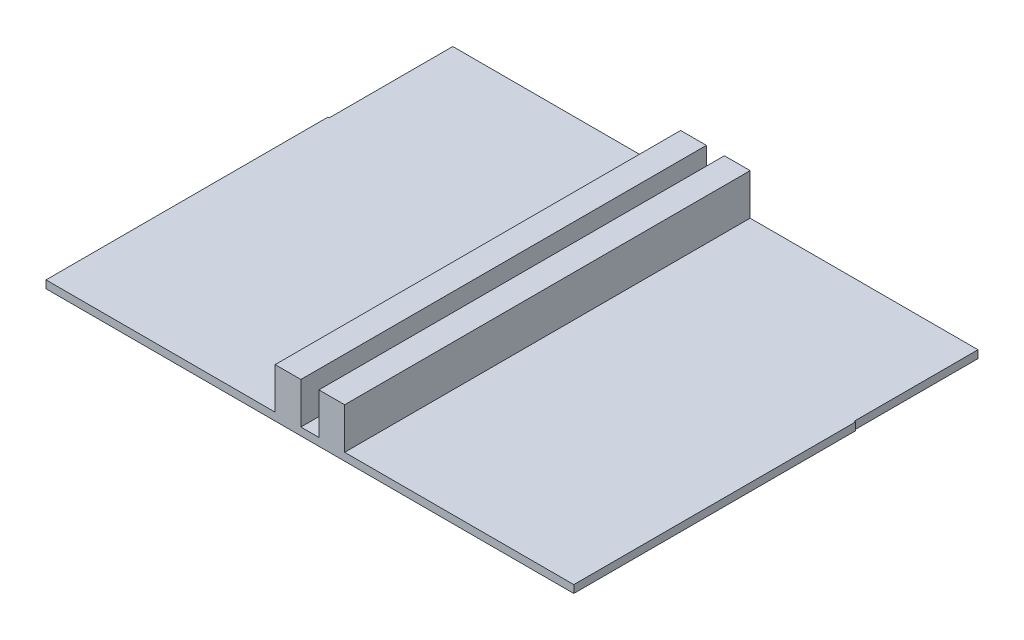
ISO-10303-21;
HEADER;
FILE_DESCRIPTION(('STEP AP214'),'2;1');
FILE_NAME('part.step','',(''),(''),'','','');
FILE_SCHEMA(('AUTOMOTIVE_DESIGN { 1 0 10303 214 1 1 1 1 }'));
ENDSEC;
DATA;
#1=APPLICATION_CONTEXT('core data for automotive mechanical design processes');
#2=APPLICATION_PROTOCOL_DEFINITION('international standard','automotive_design',2000,#1);
#3=PRODUCT_CONTEXT('',#1,'mechanical');
#4=PRODUCT('Part','Part','',(#3));
#5=PRODUCT_RELATED_PRODUCT_CATEGORY('part','',(#4));
#6=PRODUCT_DEFINITION_FORMATION('','',#4);
#7=PRODUCT_DEFINITION_CONTEXT('part definition',#1,'design');
#8=PRODUCT_DEFINITION('design','',#6,#7);
#9=PRODUCT_DEFINITION_SHAPE('','',#8);
#10=(LENGTH_UNIT() NAMED_UNIT(*) SI_UNIT(.MILLI.,.METRE.));
#11=(NAMED_UNIT(*) PLANE_ANGLE_UNIT() SI_UNIT($,.RADIAN.));
#12=(NAMED_UNIT(*) SI_UNIT($,.STERADIAN.) SOLID_ANGLE_UNIT());
#13=UNCERTAINTY_MEASURE_WITH_UNIT(LENGTH_MEASURE(1.E-05),#10,'distance_accuracy_value','');
#14=(GEOMETRIC_REPRESENTATION_CONTEXT(3) GLOBAL_UNCERTAINTY_ASSIGNED_CONTEXT((#13)) GLOBAL_UNIT_ASSIGNED_CONTEXT((#10,
#11,#12)) REPRESENTATION_CONTEXT('',''));
#15=CARTESIAN_POINT('',(0.,0.,0.));
#16=DIRECTION('',(0.,0.,1.));
#17=DIRECTION('',(1.,0.,0.));
#18=AXIS2_PLACEMENT_3D('',#15,#16,#17);
#19=CARTESIAN_POINT('',(0.,0.3,0.));
#20=DIRECTION('',(0.,1.,0.));
#21=DIRECTION('',(0.,0.,1.));
#22=AXIS2_PLACEMENT_3D('',#19,#20,#21);
#23=PLANE('',#22);
#24=DIRECTION('',(1.,0.,0.));
#25=VECTOR('',#24,1.);
#26=CARTESIAN_POINT('',(0.,0.3,0.));
#27=LINE('',#26,#25);
#28=CARTESIAN_POINT('',(1.35000000000001,0.3,0.));
#29=VERTEX_POINT('',#28);
#30=CARTESIAN_POINT('',(10.25,0.3,0.));
#31=VERTEX_POINT('',#30);
#32=EDGE_CURVE('E210',#29,#31,#27,.T.);
#33=ORIENTED_EDGE('',*,*,#32,.T.);
#34=DIRECTION('',(0.,0.,-1.));
#35=VECTOR('',#34,1.);
#36=CARTESIAN_POINT('',(10.25,0.3,0.));
#37=LINE('',#36,#35);
#38=CARTESIAN_POINT('',(10.25,0.3,-10.95));
#39=VERTEX_POINT('',#38);
#40=EDGE_CURVE('E171',#31,#39,#37,.T.);
#41=ORIENTED_EDGE('',*,*,#40,.T.);
#42=DIRECTION('',(1.,0.,0.));
#43=VECTOR('',#42,1.);
#44=CARTESIAN_POINT('',(0.,0.3,-10.95));
#45=LINE('',#44,#43);
#46=CARTESIAN_POINT('',(10.2,0.3,-10.95));
#47=VERTEX_POINT('',#46);
#48=EDGE_CURVE('E293',#47,#39,#45,.T.);
#49=ORIENTED_EDGE('',*,*,#48,.F.);
#50=DIRECTION('',(0.,0.,1.));
#51=VECTOR('',#50,1.);
#52=CARTESIAN_POINT('',(10.2,0.3,0.));
#53=LINE('',#52,#51);
#54=CARTESIAN_POINT('',(10.2,0.3,-15.75));
#55=VERTEX_POINT('',#54);
#56=EDGE_CURVE('E297',#55,#47,#53,.T.);
#57=ORIENTED_EDGE('',*,*,#56,.F.);
#58=DIRECTION('',(1.,0.,0.));
#59=VECTOR('',#58,1.);
#60=CARTESIAN_POINT('',(0.,0.3,-15.75));
#61=LINE('',#60,#59);
#62=CARTESIAN_POINT('',(1.35000000000001,0.3,-15.75));
#63=VERTEX_POINT('',#62);
#64=EDGE_CURVE('E229',#63,#55,#61,.T.);
#65=ORIENTED_EDGE('',*,*,#64,.F.);
#66=DIRECTION('',(0.,0.,-1.));
#67=VECTOR('',#66,1.);
#68=CARTESIAN_POINT('',(1.35,0.3,-15.75));
#69=LINE('',#68,#67);
#70=EDGE_CURVE('E264',#29,#63,#69,.T.);
#71=ORIENTED_EDGE('',*,*,#70,.F.);
#72=EDGE_LOOP('',(#33,#41,#49,#57,#65,#71));
#73=FACE_BOUND('',#72,.T.);
#74=ADVANCED_FACE('F34',(#73),#23,.T.);
#75=CARTESIAN_POINT('',(0.,0.3,0.));
#76=DIRECTION('',(0.,0.,-1.));
#77=DIRECTION('',(-1.,0.,0.));
#78=AXIS2_PLACEMENT_3D('',#75,#76,#77);
#79=PLANE('',#78);
#80=CARTESIAN_POINT('',(-10.25,0.3,0.));
#81=VERTEX_POINT('',#80);
#82=CARTESIAN_POINT('',(-1.35,0.3,0.));
#83=VERTEX_POINT('',#82);
#84=EDGE_CURVE('E170',#81,#83,#27,.T.);
#85=ORIENTED_EDGE('',*,*,#84,.F.);
#86=DIRECTION('',(0.,-1.,0.));
#87=VECTOR('',#86,1.);
#88=CARTESIAN_POINT('',(-10.25,10.,0.));
#89=LINE('',#88,#87);
#90=CARTESIAN_POINT('',(-10.25,0.,0.));
#91=VERTEX_POINT('',#90);
#92=EDGE_CURVE('E158',#81,#91,#89,.T.);
#93=ORIENTED_EDGE('',*,*,#92,.T.);
#94=DIRECTION('',(1.,0.,0.));
#95=VECTOR('',#94,1.);
#96=CARTESIAN_POINT('',(0.,0.,0.));
#97=LINE('',#96,#95);
#98=CARTESIAN_POINT('',(10.25,0.,0.));
#99=VERTEX_POINT('',#98);
#100=EDGE_CURVE('E168',#91,#99,#97,.T.);
#101=ORIENTED_EDGE('',*,*,#100,.T.);
#102=DIRECTION('',(0.,-1.,0.));
#103=VECTOR('',#102,1.);
#104=CARTESIAN_POINT('',(10.25,10.,0.));
#105=LINE('',#104,#103);
#106=EDGE_CURVE('E57',#31,#99,#105,.T.);
#107=ORIENTED_EDGE('',*,*,#106,.F.);
#108=ORIENTED_EDGE('',*,*,#32,.F.);
#109=DIRECTION('',(0.,-1.,0.));
#110=VECTOR('',#109,1.);
#111=CARTESIAN_POINT('',(1.35000000000001,1.9,0.));
#112=LINE('',#111,#110);
#113=CARTESIAN_POINT('',(1.35000000000001,1.9,0.));
#114=VERTEX_POINT('',#113);
#115=EDGE_CURVE('E256',#114,#29,#112,.T.);
#116=ORIENTED_EDGE('',*,*,#115,.F.);
#117=DIRECTION('',(1.,0.,0.));
#118=VECTOR('',#117,1.);
#119=CARTESIAN_POINT('',(0.35000000000001,1.9,0.));
#120=LINE('',#119,#118);
#121=CARTESIAN_POINT('',(0.35000000000001,1.9,0.));
#122=VERTEX_POINT('',#121);
#123=EDGE_CURVE('E258',#122,#114,#120,.T.);
#124=ORIENTED_EDGE('',*,*,#123,.F.);
#125=DIRECTION('',(0.,-1.,0.));
#126=VECTOR('',#125,1.);
#127=CARTESIAN_POINT('',(0.35000000000001,1.9,0.));
#128=LINE('',#127,#126);
#129=CARTESIAN_POINT('',(0.349999999999996,0.3,0.));
#130=VERTEX_POINT('',#129);
#131=EDGE_CURVE('E270',#122,#130,#128,.T.);
#132=ORIENTED_EDGE('',*,*,#131,.T.);
#133=CARTESIAN_POINT('',(-0.35,0.3,0.));
#134=VERTEX_POINT('',#133);
#135=EDGE_CURVE('E294',#134,#130,#27,.T.);
#136=ORIENTED_EDGE('',*,*,#135,.F.);
#137=DIRECTION('',(0.,-1.,0.));
#138=VECTOR('',#137,1.);
#139=CARTESIAN_POINT('',(-0.35,1.9,0.));
#140=LINE('',#139,#138);
#141=CARTESIAN_POINT('',(-0.35,1.9,0.));
#142=VERTEX_POINT('',#141);
#143=EDGE_CURVE('E284',#142,#134,#140,.T.);
#144=ORIENTED_EDGE('',*,*,#143,.F.);
#145=DIRECTION('',(1.,0.,0.));
#146=VECTOR('',#145,1.);
#147=CARTESIAN_POINT('',(-0.35,1.9,0.));
#148=LINE('',#147,#146);
#149=CARTESIAN_POINT('',(-1.35,1.9,0.));
#150=VERTEX_POINT('',#149);
#151=EDGE_CURVE('E282',#150,#142,#148,.T.);
#152=ORIENTED_EDGE('',*,*,#151,.F.);
#153=DIRECTION('',(0.,-1.,0.));
#154=VECTOR('',#153,1.);
#155=CARTESIAN_POINT('',(-1.35,1.9,0.));
#156=LINE('',#155,#154);
#157=EDGE_CURVE('E182',#150,#83,#156,.T.);
#158=ORIENTED_EDGE('',*,*,#157,.T.);
#159=EDGE_LOOP('',(#85,#93,#101,#107,#108,#116,#124,#132,#136,#144,#152,#158));
#160=FACE_BOUND('',#159,.T.);
#161=ADVANCED_FACE('F36',(#160),#79,.F.);
#162=CARTESIAN_POINT('',(0.,0.3,-10.95));
#163=DIRECTION('',(0.,0.,-1.));
#164=DIRECTION('',(-1.,0.,0.));
#165=AXIS2_PLACEMENT_3D('',#162,#163,#164);
#166=PLANE('',#165);
#167=ORIENTED_EDGE('',*,*,#48,.T.);
#168=DIRECTION('',(0.,-1.,0.));
#169=VECTOR('',#168,1.);
#170=CARTESIAN_POINT('',(10.25,10.,-10.95));
#171=LINE('',#170,#169);
#172=CARTESIAN_POINT('',(10.25,0.,-10.95));
#173=VERTEX_POINT('',#172);
#174=EDGE_CURVE('E163',#39,#173,#171,.T.);
#175=ORIENTED_EDGE('',*,*,#174,.T.);
#176=DIRECTION('',(1.,0.,0.));
#177=VECTOR('',#176,1.);
#178=CARTESIAN_POINT('',(0.,0.,-10.95));
#179=LINE('',#178,#177);
#180=CARTESIAN_POINT('',(10.2,0.,-10.95));
#181=VERTEX_POINT('',#180);
#182=EDGE_CURVE('E176',#181,#173,#179,.T.);
#183=ORIENTED_EDGE('',*,*,#182,.F.);
#184=DIRECTION('',(0.,-1.,0.));
#185=VECTOR('',#184,1.);
#186=CARTESIAN_POINT('',(10.2,0.3,-10.95));
#187=LINE('',#186,#185);
#188=EDGE_CURVE('E11',#47,#181,#187,.T.);
#189=ORIENTED_EDGE('',*,*,#188,.F.);
#190=EDGE_LOOP('',(#167,#175,#183,#189));
#191=FACE_BOUND('',#190,.T.);
#192=ADVANCED_FACE('F328',(#191),#166,.T.);
#193=CARTESIAN_POINT('',(0.,0.,0.));
#194=DIRECTION('',(0.,1.,0.));
#195=DIRECTION('',(0.,0.,1.));
#196=AXIS2_PLACEMENT_3D('',#193,#194,#195);
#197=PLANE('',#196);
#198=ORIENTED_EDGE('',*,*,#100,.F.);
#199=DIRECTION('',(0.,0.,1.));
#200=VECTOR('',#199,1.);
#201=CARTESIAN_POINT('',(-10.25,0.,0.));
#202=LINE('',#201,#200);
#203=CARTESIAN_POINT('',(-10.25,0.,-10.95));
#204=VERTEX_POINT('',#203);
#205=EDGE_CURVE('E155',#204,#91,#202,.T.);
#206=ORIENTED_EDGE('',*,*,#205,.F.);
#207=DIRECTION('',(1.,0.,0.));
#208=VECTOR('',#207,1.);
#209=CARTESIAN_POINT('',(0.,0.,-10.95));
#210=LINE('',#209,#208);
#211=CARTESIAN_POINT('',(-10.2,0.,-10.95));
#212=VERTEX_POINT('',#211);
#213=EDGE_CURVE('E208',#204,#212,#210,.T.);
#214=ORIENTED_EDGE('',*,*,#213,.T.);
#215=DIRECTION('',(0.,0.,1.));
#216=VECTOR('',#215,1.);
#217=CARTESIAN_POINT('',(-10.2,0.,0.));
#218=LINE('',#217,#216);
#219=CARTESIAN_POINT('',(-10.2,0.,-15.75));
#220=VERTEX_POINT('',#219);
#221=EDGE_CURVE('E205',#220,#212,#218,.T.);
#222=ORIENTED_EDGE('',*,*,#221,.F.);
#223=DIRECTION('',(1.,0.,0.));
#224=VECTOR('',#223,1.);
#225=CARTESIAN_POINT('',(0.,0.,-15.75));
#226=LINE('',#225,#224);
#227=CARTESIAN_POINT('',(-0.35,0.,-15.75));
#228=VERTEX_POINT('',#227);
#229=EDGE_CURVE('E202',#220,#228,#226,.T.);
#230=ORIENTED_EDGE('',*,*,#229,.T.);
#231=DIRECTION('',(0.,0.,1.));
#232=VECTOR('',#231,1.);
#233=CARTESIAN_POINT('',(-0.35,0.,0.));
#234=LINE('',#233,#232);
#235=CARTESIAN_POINT('',(-0.35,0.,-11.));
#236=VERTEX_POINT('',#235);
#237=EDGE_CURVE('E199',#228,#236,#234,.T.);
#238=ORIENTED_EDGE('',*,*,#237,.T.);
#239=DIRECTION('',(1.,0.,0.));
#240=VECTOR('',#239,1.);
#241=CARTESIAN_POINT('',(0.,0.,-11.));
#242=LINE('',#241,#240);
#243=CARTESIAN_POINT('',(0.35,0.,-11.));
#244=VERTEX_POINT('',#243);
#245=EDGE_CURVE('E196',#236,#244,#242,.T.);
#246=ORIENTED_EDGE('',*,*,#245,.T.);
#247=DIRECTION('',(0.,0.,1.));
#248=VECTOR('',#247,1.);
#249=CARTESIAN_POINT('',(0.35,0.,0.));
#250=LINE('',#249,#248);
#251=CARTESIAN_POINT('',(0.35,0.,-15.75));
#252=VERTEX_POINT('',#251);
#253=EDGE_CURVE('E193',#252,#244,#250,.T.);
#254=ORIENTED_EDGE('',*,*,#253,.F.);
#255=DIRECTION('',(1.,0.,0.));
#256=VECTOR('',#255,1.);
#257=CARTESIAN_POINT('',(0.,0.,-15.75));
#258=LINE('',#257,#256);
#259=CARTESIAN_POINT('',(10.2,0.,-15.75));
#260=VERTEX_POINT('',#259);
#261=EDGE_CURVE('E190',#252,#260,#258,.T.);
#262=ORIENTED_EDGE('',*,*,#261,.T.);
#263=DIRECTION('',(0.,0.,1.));
#264=VECTOR('',#263,1.);
#265=CARTESIAN_POINT('',(10.2,0.,0.));
#266=LINE('',#265,#264);
#267=EDGE_CURVE('E179',#260,#181,#266,.T.);
#268=ORIENTED_EDGE('',*,*,#267,.T.);
#269=ORIENTED_EDGE('',*,*,#182,.T.);
#270=DIRECTION('',(0.,0.,1.));
#271=VECTOR('',#270,1.);
#272=CARTESIAN_POINT('',(10.25,0.,0.));
#273=LINE('',#272,#271);
#274=EDGE_CURVE('E175',#173,#99,#273,.T.);
#275=ORIENTED_EDGE('',*,*,#274,.T.);
#276=EDGE_LOOP('',(#198,#206,#214,#222,#230,#238,#246,#254,#262,#268,#269,#275));
#277=FACE_BOUND('',#276,.T.);
#278=ADVANCED_FACE('F173',(#277),#197,.F.);
#279=ORIENTED_EDGE('',*,*,#135,.T.);
#280=DIRECTION('',(0.,0.,1.));
#281=VECTOR('',#280,1.);
#282=CARTESIAN_POINT('',(0.349999999999996,0.3,-15.75));
#283=LINE('',#282,#281);
#284=CARTESIAN_POINT('',(0.35,0.3,-11.));
#285=VERTEX_POINT('',#284);
#286=EDGE_CURVE('E262',#285,#130,#283,.T.);
#287=ORIENTED_EDGE('',*,*,#286,.F.);
#288=DIRECTION('',(1.,0.,0.));
#289=VECTOR('',#288,1.);
#290=CARTESIAN_POINT('',(0.,0.3,-11.));
#291=LINE('',#290,#289);
#292=CARTESIAN_POINT('',(-0.35,0.3,-11.));
#293=VERTEX_POINT('',#292);
#294=EDGE_CURVE('E300',#293,#285,#291,.T.);
#295=ORIENTED_EDGE('',*,*,#294,.F.);
#296=DIRECTION('',(0.,0.,-1.));
#297=VECTOR('',#296,1.);
#298=CARTESIAN_POINT('',(-0.35,0.3,-15.75));
#299=LINE('',#298,#297);
#300=EDGE_CURVE('E273',#134,#293,#299,.T.);
#301=ORIENTED_EDGE('',*,*,#300,.F.);
#302=EDGE_LOOP('',(#279,#287,#295,#301));
#303=FACE_BOUND('',#302,.T.);
#304=ADVANCED_FACE('F344',(#303),#23,.T.);
#305=CARTESIAN_POINT('',(10.2,0.3,0.));
#306=DIRECTION('',(1.,0.,0.));
#307=DIRECTION('',(0.,0.,-1.));
#308=AXIS2_PLACEMENT_3D('',#305,#306,#307);
#309=PLANE('',#308);
#310=ORIENTED_EDGE('',*,*,#267,.F.);
#311=DIRECTION('',(0.,-1.,0.));
#312=VECTOR('',#311,1.);
#313=CARTESIAN_POINT('',(10.2,0.3,-15.75));
#314=LINE('',#313,#312);
#315=EDGE_CURVE('E42',#55,#260,#314,.T.);
#316=ORIENTED_EDGE('',*,*,#315,.F.);
#317=ORIENTED_EDGE('',*,*,#56,.T.);
#318=ORIENTED_EDGE('',*,*,#188,.T.);
#319=EDGE_LOOP('',(#310,#316,#317,#318));
#320=FACE_BOUND('',#319,.T.);
#321=ADVANCED_FACE('F233',(#320),#309,.T.);
#322=CARTESIAN_POINT('',(0.,0.3,-15.75));
#323=DIRECTION('',(0.,0.,-1.));
#324=DIRECTION('',(-1.,0.,0.));
#325=AXIS2_PLACEMENT_3D('',#322,#323,#324);
#326=PLANE('',#325);
#327=ORIENTED_EDGE('',*,*,#261,.F.);
#328=DIRECTION('',(0.,-1.,0.));
#329=VECTOR('',#328,1.);
#330=CARTESIAN_POINT('',(0.35,0.3,-15.75));
#331=LINE('',#330,#329);
#332=CARTESIAN_POINT('',(0.349999999999996,1.9,-15.75));
#333=VERTEX_POINT('',#332);
#334=EDGE_CURVE('E222',#333,#252,#331,.T.);
#335=ORIENTED_EDGE('',*,*,#334,.F.);
#336=DIRECTION('',(-1.,0.,0.));
#337=VECTOR('',#336,1.);
#338=CARTESIAN_POINT('',(0.349999999999996,1.9,-15.75));
#339=LINE('',#338,#337);
#340=CARTESIAN_POINT('',(1.35,1.9,-15.75));
#341=VERTEX_POINT('',#340);
#342=EDGE_CURVE('E248',#341,#333,#339,.T.);
#343=ORIENTED_EDGE('',*,*,#342,.F.);
#344=DIRECTION('',(0.,-1.,0.));
#345=VECTOR('',#344,1.);
#346=CARTESIAN_POINT('',(1.35,1.9,-15.75));
#347=LINE('',#346,#345);
#348=EDGE_CURVE('E254',#341,#63,#347,.T.);
#349=ORIENTED_EDGE('',*,*,#348,.T.);
#350=ORIENTED_EDGE('',*,*,#64,.T.);
#351=ORIENTED_EDGE('',*,*,#315,.T.);
#352=EDGE_LOOP('',(#327,#335,#343,#349,#350,#351));
#353=FACE_BOUND('',#352,.T.);
#354=ADVANCED_FACE('F227',(#353),#326,.T.);
#355=CARTESIAN_POINT('',(0.35,0.3,0.));
#356=DIRECTION('',(1.,0.,0.));
#357=DIRECTION('',(0.,0.,-1.));
#358=AXIS2_PLACEMENT_3D('',#355,#356,#357);
#359=PLANE('',#358);
#360=ORIENTED_EDGE('',*,*,#253,.T.);
#361=DIRECTION('',(0.,-1.,0.));
#362=VECTOR('',#361,1.);
#363=CARTESIAN_POINT('',(0.35,0.3,-11.));
#364=LINE('',#363,#362);
#365=EDGE_CURVE('E220',#285,#244,#364,.T.);
#366=ORIENTED_EDGE('',*,*,#365,.F.);
#367=ORIENTED_EDGE('',*,*,#286,.T.);
#368=ORIENTED_EDGE('',*,*,#131,.F.);
#369=DIRECTION('',(0.,0.,1.));
#370=VECTOR('',#369,1.);
#371=CARTESIAN_POINT('',(0.349999999999996,1.9,-15.75));
#372=LINE('',#371,#370);
#373=EDGE_CURVE('E245',#333,#122,#372,.T.);
#374=ORIENTED_EDGE('',*,*,#373,.F.);
#375=ORIENTED_EDGE('',*,*,#334,.T.);
#376=EDGE_LOOP('',(#360,#366,#367,#368,#374,#375));
#377=FACE_BOUND('',#376,.T.);
#378=ADVANCED_FACE('F239',(#377),#359,.F.);
#379=CARTESIAN_POINT('',(0.,0.3,-11.));
#380=DIRECTION('',(0.,0.,-1.));
#381=DIRECTION('',(-1.,0.,0.));
#382=AXIS2_PLACEMENT_3D('',#379,#380,#381);
#383=PLANE('',#382);
#384=ORIENTED_EDGE('',*,*,#245,.F.);
#385=DIRECTION('',(0.,-1.,0.));
#386=VECTOR('',#385,1.);
#387=CARTESIAN_POINT('',(-0.35,0.3,-11.));
#388=LINE('',#387,#386);
#389=EDGE_CURVE('E218',#293,#236,#388,.T.);
#390=ORIENTED_EDGE('',*,*,#389,.F.);
#391=ORIENTED_EDGE('',*,*,#294,.T.);
#392=ORIENTED_EDGE('',*,*,#365,.T.);
#393=EDGE_LOOP('',(#384,#390,#391,#392));
#394=FACE_BOUND('',#393,.T.);
#395=ADVANCED_FACE('F377',(#394),#383,.T.);
#396=CARTESIAN_POINT('',(-0.35,0.3,0.));
#397=DIRECTION('',(1.,0.,0.));
#398=DIRECTION('',(0.,0.,-1.));
#399=AXIS2_PLACEMENT_3D('',#396,#397,#398);
#400=PLANE('',#399);
#401=ORIENTED_EDGE('',*,*,#237,.F.);
#402=DIRECTION('',(0.,-1.,0.));
#403=VECTOR('',#402,1.);
#404=CARTESIAN_POINT('',(-0.35,0.3,-15.75));
#405=LINE('',#404,#403);
#406=CARTESIAN_POINT('',(-0.35,1.9,-15.75));
#407=VERTEX_POINT('',#406);
#408=EDGE_CURVE('E216',#407,#228,#405,.T.);
#409=ORIENTED_EDGE('',*,*,#408,.F.);
#410=DIRECTION('',(0.,0.,-1.));
#411=VECTOR('',#410,1.);
#412=CARTESIAN_POINT('',(-0.35,1.9,-15.75));
#413=LINE('',#412,#411);
#414=EDGE_CURVE('E274',#142,#407,#413,.T.);
#415=ORIENTED_EDGE('',*,*,#414,.F.);
#416=ORIENTED_EDGE('',*,*,#143,.T.);
#417=ORIENTED_EDGE('',*,*,#300,.T.);
#418=ORIENTED_EDGE('',*,*,#389,.T.);
#419=EDGE_LOOP('',(#401,#409,#415,#416,#417,#418));
#420=FACE_BOUND('',#419,.T.);
#421=ADVANCED_FACE('F373',(#420),#400,.T.);
#422=CARTESIAN_POINT('',(0.,0.3,-15.75));
#423=DIRECTION('',(0.,0.,-1.));
#424=DIRECTION('',(-1.,0.,0.));
#425=AXIS2_PLACEMENT_3D('',#422,#423,#424);
#426=PLANE('',#425);
#427=ORIENTED_EDGE('',*,*,#229,.F.);
#428=DIRECTION('',(0.,-1.,0.));
#429=VECTOR('',#428,1.);
#430=CARTESIAN_POINT('',(-10.2,0.3,-15.75));
#431=LINE('',#430,#429);
#432=CARTESIAN_POINT('',(-10.2,0.3,-15.75));
#433=VERTEX_POINT('',#432);
#434=EDGE_CURVE('E214',#433,#220,#431,.T.);
#435=ORIENTED_EDGE('',*,*,#434,.F.);
#436=DIRECTION('',(1.,0.,0.));
#437=VECTOR('',#436,1.);
#438=CARTESIAN_POINT('',(0.,0.3,-15.75));
#439=LINE('',#438,#437);
#440=CARTESIAN_POINT('',(-1.35,0.3,-15.75));
#441=VERTEX_POINT('',#440);
#442=EDGE_CURVE('E302',#433,#441,#439,.T.);
#443=ORIENTED_EDGE('',*,*,#442,.T.);
#444=DIRECTION('',(0.,-1.,0.));
#445=VECTOR('',#444,1.);
#446=CARTESIAN_POINT('',(-1.35,1.9,-15.75));
#447=LINE('',#446,#445);
#448=CARTESIAN_POINT('',(-1.35,1.9,-15.75));
#449=VERTEX_POINT('',#448);
#450=EDGE_CURVE('E177',#449,#441,#447,.T.);
#451=ORIENTED_EDGE('',*,*,#450,.F.);
#452=DIRECTION('',(-1.,0.,0.));
#453=VECTOR('',#452,1.);
#454=CARTESIAN_POINT('',(-0.35,1.9,-15.75));
#455=LINE('',#454,#453);
#456=EDGE_CURVE('E277',#407,#449,#455,.T.);
#457=ORIENTED_EDGE('',*,*,#456,.F.);
#458=ORIENTED_EDGE('',*,*,#408,.T.);
#459=EDGE_LOOP('',(#427,#435,#443,#451,#457,#458));
#460=FACE_BOUND('',#459,.T.);
#461=ADVANCED_FACE('F367',(#460),#426,.T.);
#462=CARTESIAN_POINT('',(-10.2,0.3,0.));
#463=DIRECTION('',(1.,0.,0.));
#464=DIRECTION('',(0.,0.,-1.));
#465=AXIS2_PLACEMENT_3D('',#462,#463,#464);
#466=PLANE('',#465);
#467=ORIENTED_EDGE('',*,*,#221,.T.);
#468=DIRECTION('',(0.,-1.,0.));
#469=VECTOR('',#468,1.);
#470=CARTESIAN_POINT('',(-10.2,0.3,-10.95));
#471=LINE('',#470,#469);
#472=CARTESIAN_POINT('',(-10.2,0.3,-10.95));
#473=VERTEX_POINT('',#472);
#474=EDGE_CURVE('E211',#473,#212,#471,.T.);
#475=ORIENTED_EDGE('',*,*,#474,.F.);
#476=DIRECTION('',(0.,0.,1.));
#477=VECTOR('',#476,1.);
#478=CARTESIAN_POINT('',(-10.2,0.3,0.));
#479=LINE('',#478,#477);
#480=EDGE_CURVE('E304',#433,#473,#479,.T.);
#481=ORIENTED_EDGE('',*,*,#480,.F.);
#482=ORIENTED_EDGE('',*,*,#434,.T.);
#483=EDGE_LOOP('',(#467,#475,#481,#482));
#484=FACE_BOUND('',#483,.T.);
#485=ADVANCED_FACE('F361',(#484),#466,.F.);
#486=CARTESIAN_POINT('',(0.,0.3,-10.95));
#487=DIRECTION('',(0.,0.,-1.));
#488=DIRECTION('',(-1.,0.,0.));
#489=AXIS2_PLACEMENT_3D('',#486,#487,#488);
#490=PLANE('',#489);
#491=DIRECTION('',(0.,-1.,0.));
#492=VECTOR('',#491,1.);
#493=CARTESIAN_POINT('',(-10.25,10.,-10.95));
#494=LINE('',#493,#492);
#495=CARTESIAN_POINT('',(-10.25,0.3,-10.95));
#496=VERTEX_POINT('',#495);
#497=EDGE_CURVE('E49',#496,#204,#494,.T.);
#498=ORIENTED_EDGE('',*,*,#497,.F.);
#499=DIRECTION('',(1.,0.,0.));
#500=VECTOR('',#499,1.);
#501=CARTESIAN_POINT('',(0.,0.3,-10.95));
#502=LINE('',#501,#500);
#503=EDGE_CURVE('E185',#496,#473,#502,.T.);
#504=ORIENTED_EDGE('',*,*,#503,.T.);
#505=ORIENTED_EDGE('',*,*,#474,.T.);
#506=ORIENTED_EDGE('',*,*,#213,.F.);
#507=EDGE_LOOP('',(#498,#504,#505,#506));
#508=FACE_BOUND('',#507,.T.);
#509=ADVANCED_FACE('F312',(#508),#490,.T.);
#510=DIRECTION('',(0.,0.,-1.));
#511=VECTOR('',#510,1.);
#512=CARTESIAN_POINT('',(-10.25,0.3,0.));
#513=LINE('',#512,#511);
#514=EDGE_CURVE('E265',#81,#496,#513,.T.);
#515=ORIENTED_EDGE('',*,*,#514,.F.);
#516=ORIENTED_EDGE('',*,*,#84,.T.);
#517=DIRECTION('',(0.,0.,1.));
#518=VECTOR('',#517,1.);
#519=CARTESIAN_POINT('',(-1.35,0.3,-15.75));
#520=LINE('',#519,#518);
#521=EDGE_CURVE('E278',#441,#83,#520,.T.);
#522=ORIENTED_EDGE('',*,*,#521,.F.);
#523=ORIENTED_EDGE('',*,*,#442,.F.);
#524=ORIENTED_EDGE('',*,*,#480,.T.);
#525=ORIENTED_EDGE('',*,*,#503,.F.);
#526=EDGE_LOOP('',(#515,#516,#522,#523,#524,#525));
#527=FACE_BOUND('',#526,.T.);
#528=ADVANCED_FACE('F313',(#527),#23,.T.);
#529=CARTESIAN_POINT('',(-1.35,1.9,-15.75));
#530=DIRECTION('',(1.,0.,0.));
#531=DIRECTION('',(0.,0.,-1.));
#532=AXIS2_PLACEMENT_3D('',#529,#530,#531);
#533=PLANE('',#532);
#534=ORIENTED_EDGE('',*,*,#521,.T.);
#535=ORIENTED_EDGE('',*,*,#157,.F.);
#536=DIRECTION('',(0.,0.,1.));
#537=VECTOR('',#536,1.);
#538=CARTESIAN_POINT('',(-1.35,1.9,-15.75));
#539=LINE('',#538,#537);
#540=EDGE_CURVE('E280',#449,#150,#539,.T.);
#541=ORIENTED_EDGE('',*,*,#540,.F.);
#542=ORIENTED_EDGE('',*,*,#450,.T.);
#543=EDGE_LOOP('',(#534,#535,#541,#542));
#544=FACE_BOUND('',#543,.T.);
#545=ADVANCED_FACE('F354',(#544),#533,.F.);
#546=CARTESIAN_POINT('',(0.,1.9,0.));
#547=DIRECTION('',(0.,-1.,0.));
#548=DIRECTION('',(0.,0.,-1.));
#549=AXIS2_PLACEMENT_3D('',#546,#547,#548);
#550=PLANE('',#549);
#551=ORIENTED_EDGE('',*,*,#414,.T.);
#552=ORIENTED_EDGE('',*,*,#456,.T.);
#553=ORIENTED_EDGE('',*,*,#540,.T.);
#554=ORIENTED_EDGE('',*,*,#151,.T.);
#555=EDGE_LOOP('',(#551,#552,#553,#554));
#556=FACE_BOUND('',#555,.T.);
#557=ADVANCED_FACE('F359',(#556),#550,.F.);
#558=CARTESIAN_POINT('',(1.35,1.9,-15.75));
#559=DIRECTION('',(-1.,0.,0.));
#560=DIRECTION('',(0.,0.,1.));
#561=AXIS2_PLACEMENT_3D('',#558,#559,#560);
#562=PLANE('',#561);
#563=ORIENTED_EDGE('',*,*,#70,.T.);
#564=ORIENTED_EDGE('',*,*,#348,.F.);
#565=DIRECTION('',(0.,0.,-1.));
#566=VECTOR('',#565,1.);
#567=CARTESIAN_POINT('',(1.35,1.9,-15.75));
#568=LINE('',#567,#566);
#569=EDGE_CURVE('E252',#114,#341,#568,.T.);
#570=ORIENTED_EDGE('',*,*,#569,.F.);
#571=ORIENTED_EDGE('',*,*,#115,.T.);
#572=EDGE_LOOP('',(#563,#564,#570,#571));
#573=FACE_BOUND('',#572,.T.);
#574=ADVANCED_FACE('F323',(#573),#562,.F.);
#575=CARTESIAN_POINT('',(0.,1.9,0.));
#576=DIRECTION('',(0.,1.,0.));
#577=DIRECTION('',(0.,0.,1.));
#578=AXIS2_PLACEMENT_3D('',#575,#576,#577);
#579=PLANE('',#578);
#580=ORIENTED_EDGE('',*,*,#373,.T.);
#581=ORIENTED_EDGE('',*,*,#123,.T.);
#582=ORIENTED_EDGE('',*,*,#569,.T.);
#583=ORIENTED_EDGE('',*,*,#342,.T.);
#584=EDGE_LOOP('',(#580,#581,#582,#583));
#585=FACE_BOUND('',#584,.T.);
#586=ADVANCED_FACE('F250',(#585),#579,.T.);
#587=CARTESIAN_POINT('',(10.25,10.,0.));
#588=DIRECTION('',(1.,0.,0.));
#589=DIRECTION('',(0.,0.,-1.));
#590=AXIS2_PLACEMENT_3D('',#587,#588,#589);
#591=PLANE('',#590);
#592=ORIENTED_EDGE('',*,*,#106,.T.);
#593=ORIENTED_EDGE('',*,*,#274,.F.);
#594=ORIENTED_EDGE('',*,*,#174,.F.);
#595=ORIENTED_EDGE('',*,*,#40,.F.);
#596=EDGE_LOOP('',(#592,#593,#594,#595));
#597=FACE_BOUND('',#596,.T.);
#598=ADVANCED_FACE('F332',(#597),#591,.T.);
#599=CARTESIAN_POINT('',(-10.25,10.,0.));
#600=DIRECTION('',(1.,0.,0.));
#601=DIRECTION('',(0.,0.,-1.));
#602=AXIS2_PLACEMENT_3D('',#599,#600,#601);
#603=PLANE('',#602);
#604=ORIENTED_EDGE('',*,*,#514,.T.);
#605=ORIENTED_EDGE('',*,*,#497,.T.);
#606=ORIENTED_EDGE('',*,*,#205,.T.);
#607=ORIENTED_EDGE('',*,*,#92,.F.);
#608=EDGE_LOOP('',(#604,#605,#606,#607));
#609=FACE_BOUND('',#608,.T.);
#610=ADVANCED_FACE('F157',(#609),#603,.F.);
#611=CLOSED_SHELL('',(#74,#161,#192,#278,#304,#321,#354,#378,#395,#421,#461,#485,#509,#528,#545,
#557,#574,#586,#598,#610));
#612=MANIFOLD_SOLID_BREP('B2',#611);
#613=ADVANCED_BREP_SHAPE_REPRESENTATION('',(#18,#612),#14);
#614=SHAPE_DEFINITION_REPRESENTATION(#9,#613);
ENDSEC;
END-ISO-10303-21;
